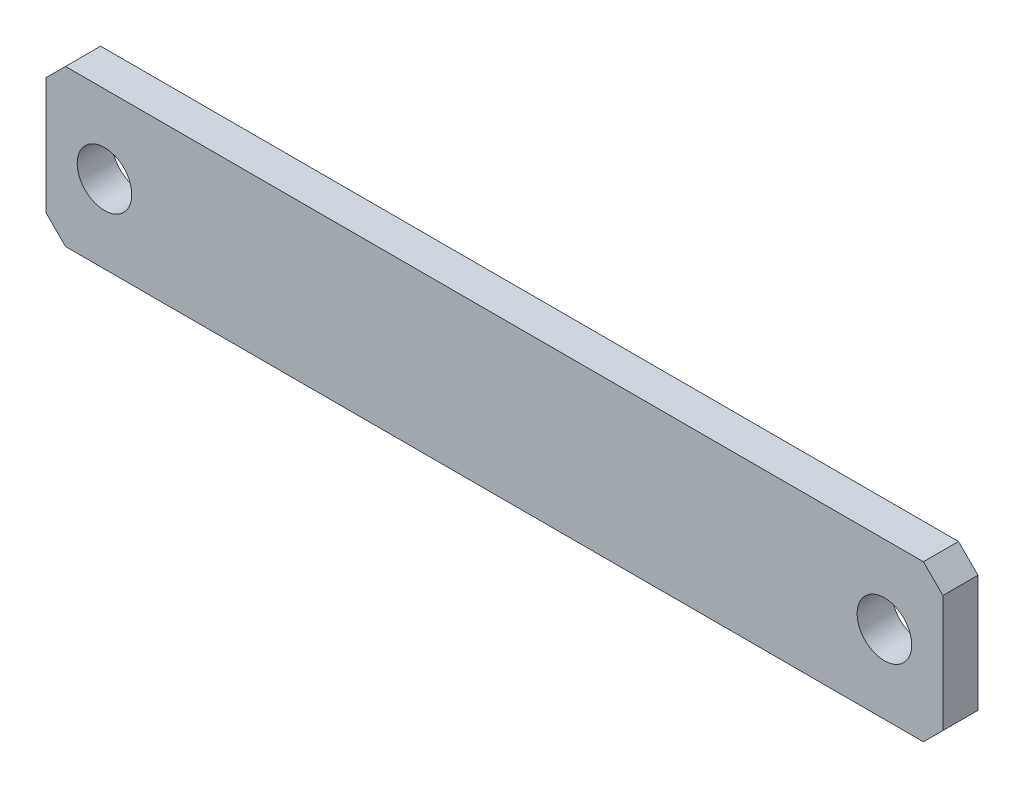
ISO-10303-21;
HEADER;
FILE_DESCRIPTION(('STEP AP214'),'2;1');
FILE_NAME('part.step','',(''),(''),'','','');
FILE_SCHEMA(('AUTOMOTIVE_DESIGN { 1 0 10303 214 1 1 1 1 }'));
ENDSEC;
DATA;
#1=APPLICATION_CONTEXT('core data for automotive mechanical design processes');
#2=APPLICATION_PROTOCOL_DEFINITION('international standard','automotive_design',2000,#1);
#3=PRODUCT_CONTEXT('',#1,'mechanical');
#4=PRODUCT('Part','Part','',(#3));
#5=PRODUCT_RELATED_PRODUCT_CATEGORY('part','',(#4));
#6=PRODUCT_DEFINITION_FORMATION('','',#4);
#7=PRODUCT_DEFINITION_CONTEXT('part definition',#1,'design');
#8=PRODUCT_DEFINITION('design','',#6,#7);
#9=PRODUCT_DEFINITION_SHAPE('','',#8);
#10=(LENGTH_UNIT() NAMED_UNIT(*) SI_UNIT(.MILLI.,.METRE.));
#11=(NAMED_UNIT(*) PLANE_ANGLE_UNIT() SI_UNIT($,.RADIAN.));
#12=(NAMED_UNIT(*) SI_UNIT($,.STERADIAN.) SOLID_ANGLE_UNIT());
#13=UNCERTAINTY_MEASURE_WITH_UNIT(LENGTH_MEASURE(1.E-05),#10,'distance_accuracy_value','');
#14=(GEOMETRIC_REPRESENTATION_CONTEXT(3) GLOBAL_UNCERTAINTY_ASSIGNED_CONTEXT((#13)) GLOBAL_UNIT_ASSIGNED_CONTEXT((#10,
#11,#12)) REPRESENTATION_CONTEXT('',''));
#15=CARTESIAN_POINT('',(0.,0.,0.));
#16=DIRECTION('',(0.,0.,1.));
#17=DIRECTION('',(1.,0.,0.));
#18=AXIS2_PLACEMENT_3D('',#15,#16,#17);
#19=CARTESIAN_POINT('',(0.,0.,0.));
#20=DIRECTION('',(0.,0.,-1.));
#21=DIRECTION('',(-1.,0.,0.));
#22=AXIS2_PLACEMENT_3D('',#19,#20,#21);
#23=PLANE('',#22);
#24=CARTESIAN_POINT('',(100.,0.,0.));
#25=DIRECTION('',(0.,0.,-1.));
#26=DIRECTION('',(-1.,0.,0.));
#27=AXIS2_PLACEMENT_3D('',#24,#25,#26);
#28=CIRCLE('',#27,7.00000000000001);
#29=CARTESIAN_POINT('',(93.,0.,0.));
#30=VERTEX_POINT('',#29);
#31=EDGE_CURVE('E107',#30,#30,#28,.F.);
#32=ORIENTED_EDGE('',*,*,#31,.T.);
#33=EDGE_LOOP('',(#32));
#34=FACE_BOUND('',#33,.T.);
#35=DIRECTION('',(-0.707106781186539,0.707106781186556,0.));
#36=VECTOR('',#35,1.);
#37=CARTESIAN_POINT('',(-115.,-15.,0.));
#38=LINE('',#37,#36);
#39=CARTESIAN_POINT('',(-110.,-20.,0.));
#40=VERTEX_POINT('',#39);
#41=CARTESIAN_POINT('',(-115.,-15.,0.));
#42=VERTEX_POINT('',#41);
#43=EDGE_CURVE('E126',#40,#42,#38,.T.);
#44=ORIENTED_EDGE('',*,*,#43,.T.);
#45=DIRECTION('',(0.,1.,0.));
#46=VECTOR('',#45,1.);
#47=CARTESIAN_POINT('',(-115.,-15.,0.));
#48=LINE('',#47,#46);
#49=CARTESIAN_POINT('',(-115.,15.,0.));
#50=VERTEX_POINT('',#49);
#51=EDGE_CURVE('E121',#42,#50,#48,.T.);
#52=ORIENTED_EDGE('',*,*,#51,.T.);
#53=DIRECTION('',(0.707106781186539,0.707106781186556,0.));
#54=VECTOR('',#53,1.);
#55=CARTESIAN_POINT('',(-115.,15.,0.));
#56=LINE('',#55,#54);
#57=CARTESIAN_POINT('',(-110.,20.,0.));
#58=VERTEX_POINT('',#57);
#59=EDGE_CURVE('E85',#50,#58,#56,.T.);
#60=ORIENTED_EDGE('',*,*,#59,.T.);
#61=DIRECTION('',(1.,0.,0.));
#62=VECTOR('',#61,1.);
#63=CARTESIAN_POINT('',(-110.,20.,0.));
#64=LINE('',#63,#62);
#65=CARTESIAN_POINT('',(110.,20.,0.));
#66=VERTEX_POINT('',#65);
#67=EDGE_CURVE('E83',#58,#66,#64,.T.);
#68=ORIENTED_EDGE('',*,*,#67,.T.);
#69=DIRECTION('',(0.707106781186556,-0.707106781186539,0.));
#70=VECTOR('',#69,1.);
#71=CARTESIAN_POINT('',(110.,20.,0.));
#72=LINE('',#71,#70);
#73=CARTESIAN_POINT('',(115.,15.,0.));
#74=VERTEX_POINT('',#73);
#75=EDGE_CURVE('E80',#66,#74,#72,.T.);
#76=ORIENTED_EDGE('',*,*,#75,.T.);
#77=DIRECTION('',(0.,1.,0.));
#78=VECTOR('',#77,1.);
#79=CARTESIAN_POINT('',(115.,15.,0.));
#80=LINE('',#79,#78);
#81=CARTESIAN_POINT('',(115.,-15.,0.));
#82=VERTEX_POINT('',#81);
#83=EDGE_CURVE('E141',#74,#82,#80,.F.);
#84=ORIENTED_EDGE('',*,*,#83,.T.);
#85=DIRECTION('',(-0.707106781186556,-0.707106781186539,0.));
#86=VECTOR('',#85,1.);
#87=CARTESIAN_POINT('',(110.,-20.,0.));
#88=LINE('',#87,#86);
#89=CARTESIAN_POINT('',(110.,-20.,0.));
#90=VERTEX_POINT('',#89);
#91=EDGE_CURVE('E136',#82,#90,#88,.T.);
#92=ORIENTED_EDGE('',*,*,#91,.T.);
#93=DIRECTION('',(1.,0.,0.));
#94=VECTOR('',#93,1.);
#95=CARTESIAN_POINT('',(-110.,-20.,0.));
#96=LINE('',#95,#94);
#97=EDGE_CURVE('E131',#90,#40,#96,.F.);
#98=ORIENTED_EDGE('',*,*,#97,.T.);
#99=EDGE_LOOP('',(#44,#52,#60,#68,#76,#84,#92,#98));
#100=FACE_BOUND('',#99,.T.);
#101=CARTESIAN_POINT('',(-100.,0.,0.));
#102=DIRECTION('',(0.,0.,-1.));
#103=DIRECTION('',(-1.,0.,0.));
#104=AXIS2_PLACEMENT_3D('',#101,#102,#103);
#105=CIRCLE('',#104,7.00000000000001);
#106=CARTESIAN_POINT('',(-107.,0.,0.));
#107=VERTEX_POINT('',#106);
#108=EDGE_CURVE('E20',#107,#107,#105,.F.);
#109=ORIENTED_EDGE('',*,*,#108,.T.);
#110=EDGE_LOOP('',(#109));
#111=FACE_BOUND('',#110,.T.);
#112=ADVANCED_FACE('F17',(#34,#100,#111),#23,.T.);
#113=CARTESIAN_POINT('',(-110.,20.,9.));
#114=DIRECTION('',(0.,-1.,0.));
#115=DIRECTION('',(0.,0.,-1.));
#116=AXIS2_PLACEMENT_3D('',#113,#114,#115);
#117=PLANE('',#116);
#118=DIRECTION('',(0.,0.,1.));
#119=VECTOR('',#118,1.);
#120=CARTESIAN_POINT('',(-110.,20.,9.));
#121=LINE('',#120,#119);
#122=CARTESIAN_POINT('',(-110.,20.,9.));
#123=VERTEX_POINT('',#122);
#124=EDGE_CURVE('E116',#58,#123,#121,.T.);
#125=ORIENTED_EDGE('',*,*,#124,.T.);
#126=DIRECTION('',(-1.,0.,0.));
#127=VECTOR('',#126,1.);
#128=CARTESIAN_POINT('',(0.,20.,9.));
#129=LINE('',#128,#127);
#130=CARTESIAN_POINT('',(110.,20.,9.));
#131=VERTEX_POINT('',#130);
#132=EDGE_CURVE('E101',#123,#131,#129,.F.);
#133=ORIENTED_EDGE('',*,*,#132,.T.);
#134=DIRECTION('',(0.,0.,1.));
#135=VECTOR('',#134,1.);
#136=CARTESIAN_POINT('',(110.,20.,9.));
#137=LINE('',#136,#135);
#138=EDGE_CURVE('E90',#131,#66,#137,.F.);
#139=ORIENTED_EDGE('',*,*,#138,.T.);
#140=ORIENTED_EDGE('',*,*,#67,.F.);
#141=EDGE_LOOP('',(#125,#133,#139,#140));
#142=FACE_BOUND('',#141,.T.);
#143=ADVANCED_FACE('F100',(#142),#117,.F.);
#144=CARTESIAN_POINT('',(110.,20.,9.));
#145=DIRECTION('',(-0.707106781186539,-0.707106781186556,0.));
#146=DIRECTION('',(0.707106781186556,-0.707106781186539,0.));
#147=AXIS2_PLACEMENT_3D('',#144,#145,#146);
#148=PLANE('',#147);
#149=ORIENTED_EDGE('',*,*,#138,.F.);
#150=DIRECTION('',(0.707106781186556,-0.707106781186539,0.));
#151=VECTOR('',#150,1.);
#152=CARTESIAN_POINT('',(110.,20.,9.));
#153=LINE('',#152,#151);
#154=CARTESIAN_POINT('',(115.,15.,9.));
#155=VERTEX_POINT('',#154);
#156=EDGE_CURVE('E111',#131,#155,#153,.T.);
#157=ORIENTED_EDGE('',*,*,#156,.T.);
#158=DIRECTION('',(0.,0.,1.));
#159=VECTOR('',#158,1.);
#160=CARTESIAN_POINT('',(115.,15.,9.));
#161=LINE('',#160,#159);
#162=EDGE_CURVE('E97',#155,#74,#161,.F.);
#163=ORIENTED_EDGE('',*,*,#162,.T.);
#164=ORIENTED_EDGE('',*,*,#75,.F.);
#165=EDGE_LOOP('',(#149,#157,#163,#164));
#166=FACE_BOUND('',#165,.T.);
#167=ADVANCED_FACE('F94',(#166),#148,.F.);
#168=CARTESIAN_POINT('',(115.,15.,9.));
#169=DIRECTION('',(-1.,0.,0.));
#170=DIRECTION('',(0.,0.,1.));
#171=AXIS2_PLACEMENT_3D('',#168,#169,#170);
#172=PLANE('',#171);
#173=ORIENTED_EDGE('',*,*,#162,.F.);
#174=DIRECTION('',(0.,1.,0.));
#175=VECTOR('',#174,1.);
#176=CARTESIAN_POINT('',(115.,0.,9.));
#177=LINE('',#176,#175);
#178=CARTESIAN_POINT('',(115.,-15.,9.));
#179=VERTEX_POINT('',#178);
#180=EDGE_CURVE('E152',#155,#179,#177,.F.);
#181=ORIENTED_EDGE('',*,*,#180,.T.);
#182=DIRECTION('',(0.,0.,1.));
#183=VECTOR('',#182,1.);
#184=CARTESIAN_POINT('',(115.,-15.,9.));
#185=LINE('',#184,#183);
#186=EDGE_CURVE('E138',#179,#82,#185,.F.);
#187=ORIENTED_EDGE('',*,*,#186,.T.);
#188=ORIENTED_EDGE('',*,*,#83,.F.);
#189=EDGE_LOOP('',(#173,#181,#187,#188));
#190=FACE_BOUND('',#189,.T.);
#191=ADVANCED_FACE('F150',(#190),#172,.F.);
#192=CARTESIAN_POINT('',(110.,-20.,9.));
#193=DIRECTION('',(-0.707106781186539,0.707106781186556,0.));
#194=DIRECTION('',(-0.707106781186556,-0.707106781186539,0.));
#195=AXIS2_PLACEMENT_3D('',#192,#193,#194);
#196=PLANE('',#195);
#197=ORIENTED_EDGE('',*,*,#186,.F.);
#198=DIRECTION('',(-0.707106781186556,-0.707106781186539,0.));
#199=VECTOR('',#198,1.);
#200=CARTESIAN_POINT('',(115.,-15.,9.));
#201=LINE('',#200,#199);
#202=CARTESIAN_POINT('',(110.,-20.,9.));
#203=VERTEX_POINT('',#202);
#204=EDGE_CURVE('E154',#179,#203,#201,.T.);
#205=ORIENTED_EDGE('',*,*,#204,.T.);
#206=DIRECTION('',(0.,0.,1.));
#207=VECTOR('',#206,1.);
#208=CARTESIAN_POINT('',(110.,-20.,9.));
#209=LINE('',#208,#207);
#210=EDGE_CURVE('E133',#203,#90,#209,.F.);
#211=ORIENTED_EDGE('',*,*,#210,.T.);
#212=ORIENTED_EDGE('',*,*,#91,.F.);
#213=EDGE_LOOP('',(#197,#205,#211,#212));
#214=FACE_BOUND('',#213,.T.);
#215=ADVANCED_FACE('F146',(#214),#196,.F.);
#216=CARTESIAN_POINT('',(-110.,-20.,9.));
#217=DIRECTION('',(0.,1.,0.));
#218=DIRECTION('',(0.,0.,1.));
#219=AXIS2_PLACEMENT_3D('',#216,#217,#218);
#220=PLANE('',#219);
#221=ORIENTED_EDGE('',*,*,#210,.F.);
#222=DIRECTION('',(-1.,0.,0.));
#223=VECTOR('',#222,1.);
#224=CARTESIAN_POINT('',(0.,-20.,9.));
#225=LINE('',#224,#223);
#226=CARTESIAN_POINT('',(-110.,-20.,9.));
#227=VERTEX_POINT('',#226);
#228=EDGE_CURVE('E156',#203,#227,#225,.T.);
#229=ORIENTED_EDGE('',*,*,#228,.T.);
#230=DIRECTION('',(0.,0.,1.));
#231=VECTOR('',#230,1.);
#232=CARTESIAN_POINT('',(-110.,-20.,9.));
#233=LINE('',#232,#231);
#234=EDGE_CURVE('E128',#227,#40,#233,.F.);
#235=ORIENTED_EDGE('',*,*,#234,.T.);
#236=ORIENTED_EDGE('',*,*,#97,.F.);
#237=EDGE_LOOP('',(#221,#229,#235,#236));
#238=FACE_BOUND('',#237,.T.);
#239=ADVANCED_FACE('F179',(#238),#220,.F.);
#240=CARTESIAN_POINT('',(-115.,-15.,9.));
#241=DIRECTION('',(0.707106781186556,0.707106781186539,0.));
#242=DIRECTION('',(-0.707106781186539,0.707106781186556,0.));
#243=AXIS2_PLACEMENT_3D('',#240,#241,#242);
#244=PLANE('',#243);
#245=ORIENTED_EDGE('',*,*,#234,.F.);
#246=DIRECTION('',(-0.707106781186539,0.707106781186556,0.));
#247=VECTOR('',#246,1.);
#248=CARTESIAN_POINT('',(-110.,-20.,9.));
#249=LINE('',#248,#247);
#250=CARTESIAN_POINT('',(-115.,-15.,9.));
#251=VERTEX_POINT('',#250);
#252=EDGE_CURVE('E161',#227,#251,#249,.T.);
#253=ORIENTED_EDGE('',*,*,#252,.T.);
#254=DIRECTION('',(0.,0.,-1.));
#255=VECTOR('',#254,1.);
#256=CARTESIAN_POINT('',(-115.,-15.,9.));
#257=LINE('',#256,#255);
#258=EDGE_CURVE('E123',#251,#42,#257,.T.);
#259=ORIENTED_EDGE('',*,*,#258,.T.);
#260=ORIENTED_EDGE('',*,*,#43,.F.);
#261=EDGE_LOOP('',(#245,#253,#259,#260));
#262=FACE_BOUND('',#261,.T.);
#263=ADVANCED_FACE('F176',(#262),#244,.F.);
#264=CARTESIAN_POINT('',(-115.,-15.,9.));
#265=DIRECTION('',(1.,0.,0.));
#266=DIRECTION('',(0.,0.,-1.));
#267=AXIS2_PLACEMENT_3D('',#264,#265,#266);
#268=PLANE('',#267);
#269=ORIENTED_EDGE('',*,*,#258,.F.);
#270=DIRECTION('',(0.,1.,0.));
#271=VECTOR('',#270,1.);
#272=CARTESIAN_POINT('',(-115.,0.,9.));
#273=LINE('',#272,#271);
#274=CARTESIAN_POINT('',(-115.,15.,9.));
#275=VERTEX_POINT('',#274);
#276=EDGE_CURVE('E164',#251,#275,#273,.T.);
#277=ORIENTED_EDGE('',*,*,#276,.T.);
#278=DIRECTION('',(0.,0.,1.));
#279=VECTOR('',#278,1.);
#280=CARTESIAN_POINT('',(-115.,15.,9.));
#281=LINE('',#280,#279);
#282=EDGE_CURVE('E35',#275,#50,#281,.F.);
#283=ORIENTED_EDGE('',*,*,#282,.T.);
#284=ORIENTED_EDGE('',*,*,#51,.F.);
#285=EDGE_LOOP('',(#269,#277,#283,#284));
#286=FACE_BOUND('',#285,.T.);
#287=ADVANCED_FACE('F172',(#286),#268,.F.);
#288=CARTESIAN_POINT('',(-115.,15.,9.));
#289=DIRECTION('',(0.707106781186556,-0.707106781186539,0.));
#290=DIRECTION('',(0.707106781186539,0.707106781186556,0.));
#291=AXIS2_PLACEMENT_3D('',#288,#289,#290);
#292=PLANE('',#291);
#293=ORIENTED_EDGE('',*,*,#282,.F.);
#294=DIRECTION('',(0.707106781186539,0.707106781186556,0.));
#295=VECTOR('',#294,1.);
#296=CARTESIAN_POINT('',(-115.,15.,9.));
#297=LINE('',#296,#295);
#298=EDGE_CURVE('E106',#275,#123,#297,.T.);
#299=ORIENTED_EDGE('',*,*,#298,.T.);
#300=ORIENTED_EDGE('',*,*,#124,.F.);
#301=ORIENTED_EDGE('',*,*,#59,.F.);
#302=EDGE_LOOP('',(#293,#299,#300,#301));
#303=FACE_BOUND('',#302,.T.);
#304=ADVANCED_FACE('F167',(#303),#292,.F.);
#305=CARTESIAN_POINT('',(-100.,0.,9.));
#306=DIRECTION('',(0.,0.,-1.));
#307=DIRECTION('',(-1.,0.,0.));
#308=AXIS2_PLACEMENT_3D('',#305,#306,#307);
#309=CYLINDRICAL_SURFACE('',#308,7.00000000000001);
#310=ORIENTED_EDGE('',*,*,#108,.F.);
#311=EDGE_LOOP('',(#310));
#312=FACE_BOUND('',#311,.T.);
#313=CARTESIAN_POINT('',(-100.,0.,9.));
#314=DIRECTION('',(0.,0.,-1.));
#315=DIRECTION('',(-1.,0.,0.));
#316=AXIS2_PLACEMENT_3D('',#313,#314,#315);
#317=CIRCLE('',#316,7.00000000000001);
#318=CARTESIAN_POINT('',(-107.,0.,9.));
#319=VERTEX_POINT('',#318);
#320=EDGE_CURVE('E26',#319,#319,#317,.F.);
#321=ORIENTED_EDGE('',*,*,#320,.T.);
#322=EDGE_LOOP('',(#321));
#323=FACE_BOUND('',#322,.T.);
#324=ADVANCED_FACE('F196',(#312,#323),#309,.F.);
#325=CARTESIAN_POINT('',(100.,0.,9.));
#326=DIRECTION('',(0.,0.,-1.));
#327=DIRECTION('',(-1.,0.,0.));
#328=AXIS2_PLACEMENT_3D('',#325,#326,#327);
#329=CYLINDRICAL_SURFACE('',#328,7.00000000000001);
#330=ORIENTED_EDGE('',*,*,#31,.F.);
#331=EDGE_LOOP('',(#330));
#332=FACE_BOUND('',#331,.T.);
#333=CARTESIAN_POINT('',(100.,0.,9.));
#334=DIRECTION('',(0.,0.,-1.));
#335=DIRECTION('',(-1.,0.,0.));
#336=AXIS2_PLACEMENT_3D('',#333,#334,#335);
#337=CIRCLE('',#336,7.00000000000001);
#338=CARTESIAN_POINT('',(93.,0.,9.));
#339=VERTEX_POINT('',#338);
#340=EDGE_CURVE('E10',#339,#339,#337,.F.);
#341=ORIENTED_EDGE('',*,*,#340,.T.);
#342=EDGE_LOOP('',(#341));
#343=FACE_BOUND('',#342,.T.);
#344=ADVANCED_FACE('F190',(#332,#343),#329,.F.);
#345=CARTESIAN_POINT('',(0.,0.,9.));
#346=DIRECTION('',(0.,0.,-1.));
#347=DIRECTION('',(-1.,0.,0.));
#348=AXIS2_PLACEMENT_3D('',#345,#346,#347);
#349=PLANE('',#348);
#350=ORIENTED_EDGE('',*,*,#340,.F.);
#351=EDGE_LOOP('',(#350));
#352=FACE_BOUND('',#351,.T.);
#353=ORIENTED_EDGE('',*,*,#320,.F.);
#354=EDGE_LOOP('',(#353));
#355=FACE_BOUND('',#354,.T.);
#356=ORIENTED_EDGE('',*,*,#276,.F.);
#357=ORIENTED_EDGE('',*,*,#252,.F.);
#358=ORIENTED_EDGE('',*,*,#228,.F.);
#359=ORIENTED_EDGE('',*,*,#204,.F.);
#360=ORIENTED_EDGE('',*,*,#180,.F.);
#361=ORIENTED_EDGE('',*,*,#156,.F.);
#362=ORIENTED_EDGE('',*,*,#132,.F.);
#363=ORIENTED_EDGE('',*,*,#298,.F.);
#364=EDGE_LOOP('',(#356,#357,#358,#359,#360,#361,#362,#363));
#365=FACE_BOUND('',#364,.T.);
#366=ADVANCED_FACE('F169',(#352,#355,#365),#349,.F.);
#367=CLOSED_SHELL('',(#112,#143,#167,#191,#215,#239,#263,#287,#304,#324,#344,#366));
#368=MANIFOLD_SOLID_BREP('B1',#367);
#369=ADVANCED_BREP_SHAPE_REPRESENTATION('',(#18,#368),#14);
#370=SHAPE_DEFINITION_REPRESENTATION(#9,#369);
ENDSEC;
END-ISO-10303-21;
